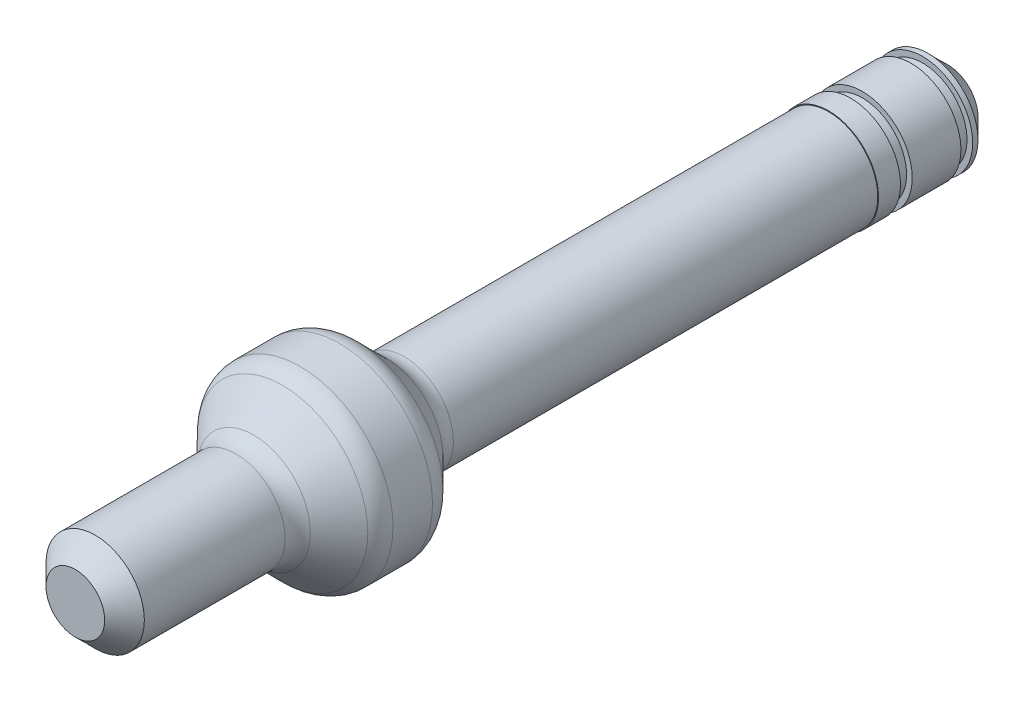
ISO-10303-21;
HEADER;
FILE_DESCRIPTION(('STEP AP214'),'2;1');
FILE_NAME('part.step','',(''),(''),'','','');
FILE_SCHEMA(('AUTOMOTIVE_DESIGN { 1 0 10303 214 1 1 1 1 }'));
ENDSEC;
DATA;
#1=APPLICATION_CONTEXT('core data for automotive mechanical design processes');
#2=APPLICATION_PROTOCOL_DEFINITION('international standard','automotive_design',2000,#1);
#3=PRODUCT_CONTEXT('',#1,'mechanical');
#4=PRODUCT('Part','Part','',(#3));
#5=PRODUCT_RELATED_PRODUCT_CATEGORY('part','',(#4));
#6=PRODUCT_DEFINITION_FORMATION('','',#4);
#7=PRODUCT_DEFINITION_CONTEXT('part definition',#1,'design');
#8=PRODUCT_DEFINITION('design','',#6,#7);
#9=PRODUCT_DEFINITION_SHAPE('','',#8);
#10=(LENGTH_UNIT() NAMED_UNIT(*) SI_UNIT(.MILLI.,.METRE.));
#11=(NAMED_UNIT(*) PLANE_ANGLE_UNIT() SI_UNIT($,.RADIAN.));
#12=(NAMED_UNIT(*) SI_UNIT($,.STERADIAN.) SOLID_ANGLE_UNIT());
#13=UNCERTAINTY_MEASURE_WITH_UNIT(LENGTH_MEASURE(1.E-05),#10,'distance_accuracy_value','');
#14=(GEOMETRIC_REPRESENTATION_CONTEXT(3) GLOBAL_UNCERTAINTY_ASSIGNED_CONTEXT((#13)) GLOBAL_UNIT_ASSIGNED_CONTEXT((#10,
#11,#12)) REPRESENTATION_CONTEXT('',''));
#15=CARTESIAN_POINT('',(0.,0.,0.));
#16=DIRECTION('',(0.,0.,1.));
#17=DIRECTION('',(1.,0.,0.));
#18=AXIS2_PLACEMENT_3D('',#15,#16,#17);
#19=CARTESIAN_POINT('',(0.,3.1496,-39.572));
#20=DIRECTION('',(0.,0.,1.));
#21=DIRECTION('',(1.,0.,0.));
#22=AXIS2_PLACEMENT_3D('',#19,#20,#21);
#23=PLANE('',#22);
#24=CARTESIAN_POINT('',(0.,0.,-39.5719999999642));
#25=DIRECTION('',(0.,0.,1.));
#26=DIRECTION('',(1.,0.,0.));
#27=AXIS2_PLACEMENT_3D('',#24,#25,#26);
#28=CIRCLE('',#27,1.89959999994471);
#29=CARTESIAN_POINT('',(1.89959999994471,0.,-39.5719999999642));
#30=VERTEX_POINT('',#29);
#31=EDGE_CURVE('E18',#30,#30,#28,.T.);
#32=ORIENTED_EDGE('',*,*,#31,.F.);
#33=EDGE_LOOP('',(#32));
#34=FACE_BOUND('',#33,.T.);
#35=ADVANCED_FACE('F15',(#34),#23,.F.);
#36=CARTESIAN_POINT('',(0.,0.,-38.3219999999369));
#37=DIRECTION('',(0.,0.,1.));
#38=DIRECTION('',(1.,0.,0.));
#39=AXIS2_PLACEMENT_3D('',#36,#37,#38);
#40=CONICAL_SURFACE('',#39,3.149599999972,0.785398163397448);
#41=ORIENTED_EDGE('',*,*,#31,.T.);
#42=EDGE_LOOP('',(#41));
#43=FACE_BOUND('',#42,.T.);
#44=CARTESIAN_POINT('',(0.,0.,-38.322));
#45=DIRECTION('',(0.,0.,1.));
#46=DIRECTION('',(1.,0.,0.));
#47=AXIS2_PLACEMENT_3D('',#44,#45,#46);
#48=CIRCLE('',#47,3.1496);
#49=CARTESIAN_POINT('',(3.1496,0.,-38.322));
#50=VERTEX_POINT('',#49);
#51=EDGE_CURVE('E184',#50,#50,#48,.T.);
#52=ORIENTED_EDGE('',*,*,#51,.F.);
#53=EDGE_LOOP('',(#52));
#54=FACE_BOUND('',#53,.T.);
#55=ADVANCED_FACE('F118',(#43,#54),#40,.T.);
#56=CARTESIAN_POINT('',(0.,0.,26.453846));
#57=DIRECTION('',(0.,0.,1.));
#58=DIRECTION('',(1.,0.,0.));
#59=AXIS2_PLACEMENT_3D('',#56,#57,#58);
#60=CYLINDRICAL_SURFACE('',#59,3.1496);
#61=ORIENTED_EDGE('',*,*,#51,.T.);
#62=EDGE_LOOP('',(#61));
#63=FACE_BOUND('',#62,.T.);
#64=CARTESIAN_POINT('',(0.,0.,-37.9845000004));
#65=DIRECTION('',(0.,0.,1.));
#66=DIRECTION('',(1.,0.,0.));
#67=AXIS2_PLACEMENT_3D('',#64,#65,#66);
#68=CIRCLE('',#67,3.1496);
#69=CARTESIAN_POINT('',(3.1496,0.,-37.9845000004));
#70=VERTEX_POINT('',#69);
#71=EDGE_CURVE('E182',#70,#70,#68,.F.);
#72=ORIENTED_EDGE('',*,*,#71,.T.);
#73=EDGE_LOOP('',(#72));
#74=FACE_BOUND('',#73,.T.);
#75=ADVANCED_FACE('F115',(#63,#74),#60,.T.);
#76=CARTESIAN_POINT('',(0.,3.1,15.428));
#77=DIRECTION('',(0.,0.,-1.));
#78=DIRECTION('',(-1.,0.,0.));
#79=AXIS2_PLACEMENT_3D('',#76,#77,#78);
#80=PLANE('',#79);
#81=CARTESIAN_POINT('',(0.,0.,15.4279999999289));
#82=DIRECTION('',(0.,0.,-1.));
#83=DIRECTION('',(-1.,0.,0.));
#84=AXIS2_PLACEMENT_3D('',#81,#82,#83);
#85=CIRCLE('',#84,1.84999999999036);
#86=CARTESIAN_POINT('',(-1.84999999999036,0.,15.4279999999289));
#87=VERTEX_POINT('',#86);
#88=EDGE_CURVE('E180',#87,#87,#85,.T.);
#89=ORIENTED_EDGE('',*,*,#88,.F.);
#90=EDGE_LOOP('',(#89));
#91=FACE_BOUND('',#90,.T.);
#92=ADVANCED_FACE('F111',(#91),#80,.F.);
#93=CARTESIAN_POINT('',(0.,2.794,-37.9845));
#94=DIRECTION('',(0.,0.,-1.));
#95=DIRECTION('',(-1.,0.,0.));
#96=AXIS2_PLACEMENT_3D('',#93,#94,#95);
#97=PLANE('',#96);
#98=CARTESIAN_POINT('',(0.,0.,-37.9845000003));
#99=DIRECTION('',(0.,0.,-1.));
#100=DIRECTION('',(-1.,0.,0.));
#101=AXIS2_PLACEMENT_3D('',#98,#99,#100);
#102=CIRCLE('',#101,2.794);
#103=CARTESIAN_POINT('',(-2.794,0.,-37.9845000003));
#104=VERTEX_POINT('',#103);
#105=EDGE_CURVE('E177',#104,#104,#102,.F.);
#106=ORIENTED_EDGE('',*,*,#105,.F.);
#107=EDGE_LOOP('',(#106));
#108=FACE_BOUND('',#107,.T.);
#109=ORIENTED_EDGE('',*,*,#71,.F.);
#110=EDGE_LOOP('',(#109));
#111=FACE_BOUND('',#110,.T.);
#112=ADVANCED_FACE('F107',(#108,#111),#97,.F.);
#113=CARTESIAN_POINT('',(0.,0.,14.1780000000153));
#114=DIRECTION('',(0.,0.,-1.));
#115=DIRECTION('',(-1.,0.,0.));
#116=AXIS2_PLACEMENT_3D('',#113,#114,#115);
#117=CONICAL_SURFACE('',#116,3.09999999990396,0.785398163397448);
#118=ORIENTED_EDGE('',*,*,#88,.T.);
#119=EDGE_LOOP('',(#118));
#120=FACE_BOUND('',#119,.T.);
#121=CARTESIAN_POINT('',(0.,0.,14.178));
#122=DIRECTION('',(0.,0.,1.));
#123=DIRECTION('',(1.,0.,0.));
#124=AXIS2_PLACEMENT_3D('',#121,#122,#123);
#125=CIRCLE('',#124,3.1);
#126=CARTESIAN_POINT('',(3.1,0.,14.178));
#127=VERTEX_POINT('',#126);
#128=EDGE_CURVE('E176',#127,#127,#125,.F.);
#129=ORIENTED_EDGE('',*,*,#128,.F.);
#130=EDGE_LOOP('',(#129));
#131=FACE_BOUND('',#130,.T.);
#132=ADVANCED_FACE('F103',(#120,#131),#117,.T.);
#133=CARTESIAN_POINT('',(0.,0.,-40.0654390361));
#134=DIRECTION('',(0.,0.,-1.));
#135=DIRECTION('',(-1.,0.,0.));
#136=AXIS2_PLACEMENT_3D('',#133,#134,#135);
#137=CYLINDRICAL_SURFACE('',#136,2.794);
#138=ORIENTED_EDGE('',*,*,#105,.T.);
#139=EDGE_LOOP('',(#138));
#140=FACE_BOUND('',#139,.T.);
#141=CARTESIAN_POINT('',(0.,0.,-37.2478999999));
#142=DIRECTION('',(0.,0.,-1.));
#143=DIRECTION('',(-1.,0.,0.));
#144=AXIS2_PLACEMENT_3D('',#141,#142,#143);
#145=CIRCLE('',#144,2.794);
#146=CARTESIAN_POINT('',(-2.794,0.,-37.2478999999));
#147=VERTEX_POINT('',#146);
#148=EDGE_CURVE('E173',#147,#147,#145,.T.);
#149=ORIENTED_EDGE('',*,*,#148,.T.);
#150=EDGE_LOOP('',(#149));
#151=FACE_BOUND('',#150,.T.);
#152=ADVANCED_FACE('F99',(#140,#151),#137,.T.);
#153=CARTESIAN_POINT('',(0.,0.,26.453846));
#154=DIRECTION('',(0.,0.,1.));
#155=DIRECTION('',(1.,0.,0.));
#156=AXIS2_PLACEMENT_3D('',#153,#154,#155);
#157=CYLINDRICAL_SURFACE('',#156,3.1);
#158=CARTESIAN_POINT('',(0.,0.,5.30456403027));
#159=DIRECTION('',(0.,0.,1.));
#160=DIRECTION('',(-1.,0.,0.));
#161=AXIS2_PLACEMENT_3D('',#158,#159,#160);
#162=CIRCLE('',#161,3.1);
#163=CARTESIAN_POINT('',(-3.1,0.,5.30456403027));
#164=VERTEX_POINT('',#163);
#165=EDGE_CURVE('E83',#164,#164,#162,.T.);
#166=ORIENTED_EDGE('',*,*,#165,.T.);
#167=EDGE_LOOP('',(#166));
#168=FACE_BOUND('',#167,.T.);
#169=ORIENTED_EDGE('',*,*,#128,.T.);
#170=EDGE_LOOP('',(#169));
#171=FACE_BOUND('',#170,.T.);
#172=ADVANCED_FACE('F95',(#168,#171),#157,.T.);
#173=CARTESIAN_POINT('',(0.,2.794,-37.2479));
#174=DIRECTION('',(0.,0.,1.));
#175=DIRECTION('',(1.,0.,0.));
#176=AXIS2_PLACEMENT_3D('',#173,#174,#175);
#177=PLANE('',#176);
#178=ORIENTED_EDGE('',*,*,#148,.F.);
#179=EDGE_LOOP('',(#178));
#180=FACE_BOUND('',#179,.T.);
#181=CARTESIAN_POINT('',(0.,0.,-37.2479));
#182=DIRECTION('',(0.,0.,1.));
#183=DIRECTION('',(1.,0.,0.));
#184=AXIS2_PLACEMENT_3D('',#181,#182,#183);
#185=CIRCLE('',#184,3.1496);
#186=CARTESIAN_POINT('',(3.1496,0.,-37.2479));
#187=VERTEX_POINT('',#186);
#188=EDGE_CURVE('E80',#187,#187,#185,.T.);
#189=ORIENTED_EDGE('',*,*,#188,.F.);
#190=EDGE_LOOP('',(#189));
#191=FACE_BOUND('',#190,.T.);
#192=ADVANCED_FACE('F91',(#180,#191),#177,.F.);
#193=CARTESIAN_POINT('',(0.,0.,5.30456403027));
#194=DIRECTION('',(0.,0.,1.));
#195=DIRECTION('',(-1.,0.,0.));
#196=AXIS2_PLACEMENT_3D('',#193,#194,#195);
#197=TOROIDAL_SURFACE('',#196,4.6875,1.5875);
#198=CARTESIAN_POINT('',(0.,0.,4.18203201513734));
#199=DIRECTION('',(0.,0.,-1.));
#200=DIRECTION('',(1.,0.,0.));
#201=AXIS2_PLACEMENT_3D('',#198,#199,#200);
#202=CIRCLE('',#201,3.5649679848575);
#203=CARTESIAN_POINT('',(3.5649679848575,0.,4.18203201513734));
#204=VERTEX_POINT('',#203);
#205=EDGE_CURVE('E77',#204,#204,#202,.T.);
#206=ORIENTED_EDGE('',*,*,#205,.F.);
#207=EDGE_LOOP('',(#206));
#208=FACE_BOUND('',#207,.T.);
#209=ORIENTED_EDGE('',*,*,#165,.F.);
#210=EDGE_LOOP('',(#209));
#211=FACE_BOUND('',#210,.T.);
#212=ADVANCED_FACE('F86',(#208,#211),#197,.F.);
#213=CARTESIAN_POINT('',(0.,0.,26.453846));
#214=DIRECTION('',(0.,0.,1.));
#215=DIRECTION('',(1.,0.,0.));
#216=AXIS2_PLACEMENT_3D('',#213,#214,#215);
#217=CYLINDRICAL_SURFACE('',#216,3.1496);
#218=ORIENTED_EDGE('',*,*,#188,.T.);
#219=EDGE_LOOP('',(#218));
#220=FACE_BOUND('',#219,.T.);
#221=CARTESIAN_POINT('',(0.,0.,-34.1744999999));
#222=DIRECTION('',(0.,0.,1.));
#223=DIRECTION('',(1.,0.,0.));
#224=AXIS2_PLACEMENT_3D('',#221,#222,#223);
#225=CIRCLE('',#224,3.1496);
#226=CARTESIAN_POINT('',(3.1496,0.,-34.1744999999));
#227=VERTEX_POINT('',#226);
#228=EDGE_CURVE('E76',#227,#227,#225,.F.);
#229=ORIENTED_EDGE('',*,*,#228,.T.);
#230=EDGE_LOOP('',(#229));
#231=FACE_BOUND('',#230,.T.);
#232=ADVANCED_FACE('F90',(#220,#231),#217,.T.);
#233=CARTESIAN_POINT('',(0.,0.,2.36996798497557));
#234=DIRECTION('',(0.,0.,-1.));
#235=DIRECTION('',(-1.,0.,0.));
#236=AXIS2_PLACEMENT_3D('',#233,#234,#235);
#237=CONICAL_SURFACE('',#236,5.37703201507611,0.785398163413133);
#238=ORIENTED_EDGE('',*,*,#205,.T.);
#239=EDGE_LOOP('',(#238));
#240=FACE_BOUND('',#239,.T.);
#241=CARTESIAN_POINT('',(0.,0.,2.36996798486864));
#242=DIRECTION('',(0.,0.,-1.));
#243=DIRECTION('',(1.,0.,0.));
#244=AXIS2_PLACEMENT_3D('',#241,#242,#243);
#245=CIRCLE('',#244,5.37703201512864);
#246=CARTESIAN_POINT('',(5.37703201512864,0.,2.36996798486864));
#247=VERTEX_POINT('',#246);
#248=EDGE_CURVE('E72',#247,#247,#245,.T.);
#249=ORIENTED_EDGE('',*,*,#248,.F.);
#250=EDGE_LOOP('',(#249));
#251=FACE_BOUND('',#250,.T.);
#252=ADVANCED_FACE('F213',(#240,#251),#237,.T.);
#253=CARTESIAN_POINT('',(0.,3.1496,-34.1745));
#254=DIRECTION('',(0.,0.,-1.));
#255=DIRECTION('',(-1.,0.,0.));
#256=AXIS2_PLACEMENT_3D('',#253,#254,#255);
#257=PLANE('',#256);
#258=CARTESIAN_POINT('',(0.,0.,-34.1744999997));
#259=DIRECTION('',(0.,0.,-1.));
#260=DIRECTION('',(-1.,0.,0.));
#261=AXIS2_PLACEMENT_3D('',#258,#259,#260);
#262=CIRCLE('',#261,2.794);
#263=CARTESIAN_POINT('',(-2.794,0.,-34.1744999997));
#264=VERTEX_POINT('',#263);
#265=EDGE_CURVE('E75',#264,#264,#262,.F.);
#266=ORIENTED_EDGE('',*,*,#265,.F.);
#267=EDGE_LOOP('',(#266));
#268=FACE_BOUND('',#267,.T.);
#269=ORIENTED_EDGE('',*,*,#228,.F.);
#270=EDGE_LOOP('',(#269));
#271=FACE_BOUND('',#270,.T.);
#272=ADVANCED_FACE('F65',(#268,#271),#257,.F.);
#273=CARTESIAN_POINT('',(0.,0.,1.24743596973));
#274=DIRECTION('',(0.,0.,-1.));
#275=DIRECTION('',(1.,0.,0.));
#276=AXIS2_PLACEMENT_3D('',#273,#274,#275);
#277=TOROIDAL_SURFACE('',#276,4.2545,1.5875);
#278=CARTESIAN_POINT('',(0.,0.,1.24743596973));
#279=DIRECTION('',(0.,0.,1.));
#280=DIRECTION('',(1.,0.,0.));
#281=AXIS2_PLACEMENT_3D('',#278,#279,#280);
#282=CIRCLE('',#281,5.842);
#283=CARTESIAN_POINT('',(5.842,0.,1.24743596973));
#284=VERTEX_POINT('',#283);
#285=EDGE_CURVE('E71',#284,#284,#282,.F.);
#286=ORIENTED_EDGE('',*,*,#285,.F.);
#287=EDGE_LOOP('',(#286));
#288=FACE_BOUND('',#287,.T.);
#289=ORIENTED_EDGE('',*,*,#248,.T.);
#290=EDGE_LOOP('',(#289));
#291=FACE_BOUND('',#290,.T.);
#292=ADVANCED_FACE('F60',(#288,#291),#277,.T.);
#293=CARTESIAN_POINT('',(0.,0.,-40.0654390361));
#294=DIRECTION('',(0.,0.,-1.));
#295=DIRECTION('',(-1.,0.,0.));
#296=AXIS2_PLACEMENT_3D('',#293,#294,#295);
#297=CYLINDRICAL_SURFACE('',#296,2.794);
#298=ORIENTED_EDGE('',*,*,#265,.T.);
#299=EDGE_LOOP('',(#298));
#300=FACE_BOUND('',#299,.T.);
#301=CARTESIAN_POINT('',(0.,0.,-33.4378999993));
#302=DIRECTION('',(0.,0.,-1.));
#303=DIRECTION('',(-1.,0.,0.));
#304=AXIS2_PLACEMENT_3D('',#301,#302,#303);
#305=CIRCLE('',#304,2.794);
#306=CARTESIAN_POINT('',(-2.794,0.,-33.4378999993));
#307=VERTEX_POINT('',#306);
#308=EDGE_CURVE('E157',#307,#307,#305,.T.);
#309=ORIENTED_EDGE('',*,*,#308,.T.);
#310=EDGE_LOOP('',(#309));
#311=FACE_BOUND('',#310,.T.);
#312=ADVANCED_FACE('F56',(#300,#311),#297,.T.);
#313=CARTESIAN_POINT('',(0.,0.,26.453846));
#314=DIRECTION('',(0.,0.,1.));
#315=DIRECTION('',(1.,0.,0.));
#316=AXIS2_PLACEMENT_3D('',#313,#314,#315);
#317=CYLINDRICAL_SURFACE('',#316,5.842);
#318=CARTESIAN_POINT('',(0.,0.,-1.24743596973));
#319=DIRECTION('',(0.,0.,-1.));
#320=DIRECTION('',(1.,0.,0.));
#321=AXIS2_PLACEMENT_3D('',#318,#319,#320);
#322=CIRCLE('',#321,5.842);
#323=CARTESIAN_POINT('',(5.842,0.,-1.24743596973));
#324=VERTEX_POINT('',#323);
#325=EDGE_CURVE('E39',#324,#324,#322,.T.);
#326=ORIENTED_EDGE('',*,*,#325,.F.);
#327=EDGE_LOOP('',(#326));
#328=FACE_BOUND('',#327,.T.);
#329=ORIENTED_EDGE('',*,*,#285,.T.);
#330=EDGE_LOOP('',(#329));
#331=FACE_BOUND('',#330,.T.);
#332=ADVANCED_FACE('F52',(#328,#331),#317,.T.);
#333=CARTESIAN_POINT('',(0.,3.1496,-33.4379));
#334=DIRECTION('',(0.,0.,1.));
#335=DIRECTION('',(1.,0.,0.));
#336=AXIS2_PLACEMENT_3D('',#333,#334,#335);
#337=PLANE('',#336);
#338=ORIENTED_EDGE('',*,*,#308,.F.);
#339=EDGE_LOOP('',(#338));
#340=FACE_BOUND('',#339,.T.);
#341=CARTESIAN_POINT('',(0.,0.,-33.4378999995));
#342=DIRECTION('',(0.,0.,1.));
#343=DIRECTION('',(1.,0.,0.));
#344=AXIS2_PLACEMENT_3D('',#341,#342,#343);
#345=CIRCLE('',#344,3.1496);
#346=CARTESIAN_POINT('',(3.1496,0.,-33.4378999995));
#347=VERTEX_POINT('',#346);
#348=EDGE_CURVE('E36',#347,#347,#345,.T.);
#349=ORIENTED_EDGE('',*,*,#348,.F.);
#350=EDGE_LOOP('',(#349));
#351=FACE_BOUND('',#350,.T.);
#352=ADVANCED_FACE('F47',(#340,#351),#337,.F.);
#353=CARTESIAN_POINT('',(0.,0.,-1.24743596973));
#354=DIRECTION('',(0.,0.,-1.));
#355=DIRECTION('',(1.,0.,0.));
#356=AXIS2_PLACEMENT_3D('',#353,#354,#355);
#357=TOROIDAL_SURFACE('',#356,4.2545,1.5875);
#358=CARTESIAN_POINT('',(0.,0.,-2.36996798486189));
#359=DIRECTION('',(0.,0.,1.));
#360=DIRECTION('',(-1.,0.,0.));
#361=AXIS2_PLACEMENT_3D('',#358,#359,#360);
#362=CIRCLE('',#361,5.37703201507611);
#363=CARTESIAN_POINT('',(-5.37703201507611,0.,-2.36996798486189));
#364=VERTEX_POINT('',#363);
#365=EDGE_CURVE('E32',#364,#364,#362,.F.);
#366=ORIENTED_EDGE('',*,*,#365,.F.);
#367=EDGE_LOOP('',(#366));
#368=FACE_BOUND('',#367,.T.);
#369=ORIENTED_EDGE('',*,*,#325,.T.);
#370=EDGE_LOOP('',(#369));
#371=FACE_BOUND('',#370,.T.);
#372=ADVANCED_FACE('F42',(#368,#371),#357,.T.);
#373=CARTESIAN_POINT('',(0.,0.,26.453846));
#374=DIRECTION('',(0.,0.,1.));
#375=DIRECTION('',(1.,0.,0.));
#376=AXIS2_PLACEMENT_3D('',#373,#374,#375);
#377=CYLINDRICAL_SURFACE('',#376,3.1496);
#378=CARTESIAN_POINT('',(0.,0.,-32.0536000004));
#379=DIRECTION('',(0.,0.,1.));
#380=DIRECTION('',(1.,0.,0.));
#381=AXIS2_PLACEMENT_3D('',#378,#379,#380);
#382=CIRCLE('',#381,3.1496);
#383=CARTESIAN_POINT('',(3.1496,0.,-32.0536000004));
#384=VERTEX_POINT('',#383);
#385=EDGE_CURVE('E35',#384,#384,#382,.F.);
#386=ORIENTED_EDGE('',*,*,#385,.T.);
#387=EDGE_LOOP('',(#386));
#388=FACE_BOUND('',#387,.T.);
#389=ORIENTED_EDGE('',*,*,#348,.T.);
#390=EDGE_LOOP('',(#389));
#391=FACE_BOUND('',#390,.T.);
#392=ADVANCED_FACE('F46',(#388,#391),#377,.T.);
#393=CARTESIAN_POINT('',(0.,0.,-2.36996798486189));
#394=DIRECTION('',(0.,0.,1.));
#395=DIRECTION('',(1.,0.,0.));
#396=AXIS2_PLACEMENT_3D('',#393,#394,#395);
#397=CONICAL_SURFACE('',#396,5.37703201507611,0.785398163397448);
#398=CARTESIAN_POINT('',(0.,0.,-4.18203201513136));
#399=DIRECTION('',(0.,0.,1.));
#400=DIRECTION('',(-1.,0.,0.));
#401=AXIS2_PLACEMENT_3D('',#398,#399,#400);
#402=CIRCLE('',#401,3.56496798487136);
#403=CARTESIAN_POINT('',(-3.56496798487136,0.,-4.18203201513136));
#404=VERTEX_POINT('',#403);
#405=EDGE_CURVE('E27',#404,#404,#402,.T.);
#406=ORIENTED_EDGE('',*,*,#405,.T.);
#407=EDGE_LOOP('',(#406));
#408=FACE_BOUND('',#407,.T.);
#409=ORIENTED_EDGE('',*,*,#365,.T.);
#410=EDGE_LOOP('',(#409));
#411=FACE_BOUND('',#410,.T.);
#412=ADVANCED_FACE('F142',(#408,#411),#397,.T.);
#413=CARTESIAN_POINT('',(0.,3.1496,-32.0536));
#414=DIRECTION('',(0.,0.,-1.));
#415=DIRECTION('',(-1.,0.,0.));
#416=AXIS2_PLACEMENT_3D('',#413,#414,#415);
#417=PLANE('',#416);
#418=CARTESIAN_POINT('',(0.,0.,-32.0536000004));
#419=DIRECTION('',(0.,0.,1.));
#420=DIRECTION('',(1.,0.,0.));
#421=AXIS2_PLACEMENT_3D('',#418,#419,#420);
#422=CIRCLE('',#421,3.1);
#423=CARTESIAN_POINT('',(3.1,0.,-32.0536000004));
#424=VERTEX_POINT('',#423);
#425=EDGE_CURVE('E22',#424,#424,#422,.T.);
#426=ORIENTED_EDGE('',*,*,#425,.F.);
#427=EDGE_LOOP('',(#426));
#428=FACE_BOUND('',#427,.T.);
#429=ORIENTED_EDGE('',*,*,#385,.F.);
#430=EDGE_LOOP('',(#429));
#431=FACE_BOUND('',#430,.T.);
#432=ADVANCED_FACE('F137',(#428,#431),#417,.F.);
#433=CARTESIAN_POINT('',(0.,0.,-5.30456403027));
#434=DIRECTION('',(0.,0.,1.));
#435=DIRECTION('',(-1.,0.,0.));
#436=AXIS2_PLACEMENT_3D('',#433,#434,#435);
#437=TOROIDAL_SURFACE('',#436,4.6875,1.5875);
#438=ORIENTED_EDGE('',*,*,#405,.F.);
#439=EDGE_LOOP('',(#438));
#440=FACE_BOUND('',#439,.T.);
#441=CARTESIAN_POINT('',(0.,0.,-5.30456403027));
#442=DIRECTION('',(0.,0.,1.));
#443=DIRECTION('',(1.,0.,0.));
#444=AXIS2_PLACEMENT_3D('',#441,#442,#443);
#445=CIRCLE('',#444,3.1);
#446=CARTESIAN_POINT('',(3.1,0.,-5.30456403027));
#447=VERTEX_POINT('',#446);
#448=EDGE_CURVE('E10',#447,#447,#445,.F.);
#449=ORIENTED_EDGE('',*,*,#448,.F.);
#450=EDGE_LOOP('',(#449));
#451=FACE_BOUND('',#450,.T.);
#452=ADVANCED_FACE('F131',(#440,#451),#437,.F.);
#453=CARTESIAN_POINT('',(0.,0.,26.453846));
#454=DIRECTION('',(0.,0.,1.));
#455=DIRECTION('',(1.,0.,0.));
#456=AXIS2_PLACEMENT_3D('',#453,#454,#455);
#457=CYLINDRICAL_SURFACE('',#456,3.1);
#458=ORIENTED_EDGE('',*,*,#425,.T.);
#459=EDGE_LOOP('',(#458));
#460=FACE_BOUND('',#459,.T.);
#461=ORIENTED_EDGE('',*,*,#448,.T.);
#462=EDGE_LOOP('',(#461));
#463=FACE_BOUND('',#462,.T.);
#464=ADVANCED_FACE('F129',(#460,#463),#457,.T.);
#465=CLOSED_SHELL('',(#35,#55,#75,#92,#112,#132,#152,#172,#192,#212,#232,#252,#272,#292,#312,
#332,#352,#372,#392,#412,#432,#452,#464));
#466=MANIFOLD_SOLID_BREP('B1',#465);
#467=ADVANCED_BREP_SHAPE_REPRESENTATION('',(#18,#466),#14);
#468=SHAPE_DEFINITION_REPRESENTATION(#9,#467);
ENDSEC;
END-ISO-10303-21;
